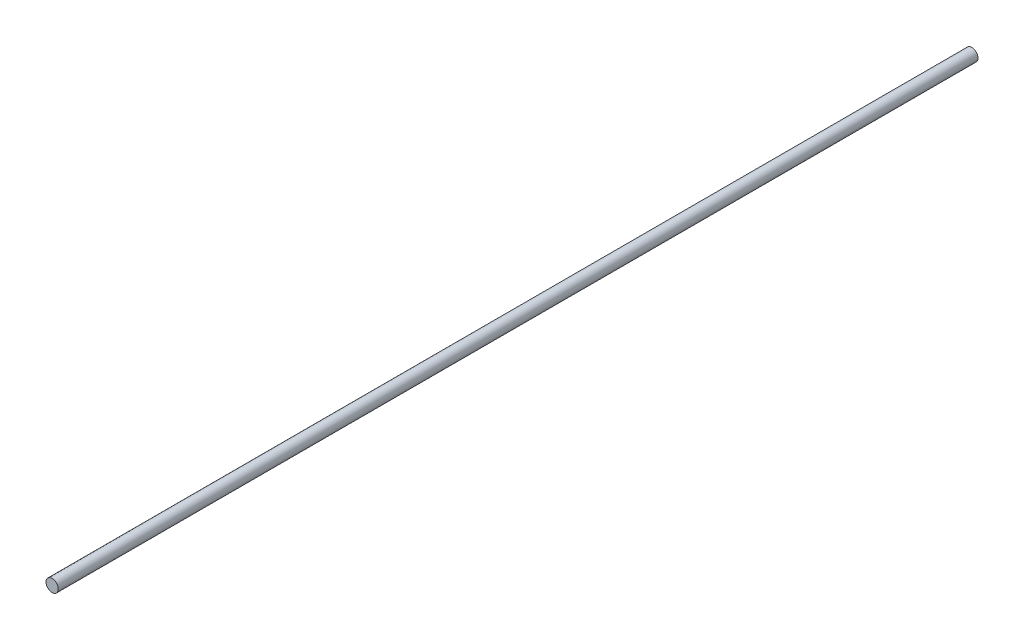
ISO-10303-21;
HEADER;
FILE_DESCRIPTION(('STEP AP214'),'2;1');
FILE_NAME('part.step','',(''),(''),'','','');
FILE_SCHEMA(('AUTOMOTIVE_DESIGN { 1 0 10303 214 1 1 1 1 }'));
ENDSEC;
DATA;
#1=APPLICATION_CONTEXT('core data for automotive mechanical design processes');
#2=APPLICATION_PROTOCOL_DEFINITION('international standard','automotive_design',2000,#1);
#3=PRODUCT_CONTEXT('',#1,'mechanical');
#4=PRODUCT('Part','Part','',(#3));
#5=PRODUCT_RELATED_PRODUCT_CATEGORY('part','',(#4));
#6=PRODUCT_DEFINITION_FORMATION('','',#4);
#7=PRODUCT_DEFINITION_CONTEXT('part definition',#1,'design');
#8=PRODUCT_DEFINITION('design','',#6,#7);
#9=PRODUCT_DEFINITION_SHAPE('','',#8);
#10=(LENGTH_UNIT() NAMED_UNIT(*) SI_UNIT(.MILLI.,.METRE.));
#11=(NAMED_UNIT(*) PLANE_ANGLE_UNIT() SI_UNIT($,.RADIAN.));
#12=(NAMED_UNIT(*) SI_UNIT($,.STERADIAN.) SOLID_ANGLE_UNIT());
#13=UNCERTAINTY_MEASURE_WITH_UNIT(LENGTH_MEASURE(1.E-05),#10,'distance_accuracy_value','');
#14=(GEOMETRIC_REPRESENTATION_CONTEXT(3) GLOBAL_UNCERTAINTY_ASSIGNED_CONTEXT((#13)) GLOBAL_UNIT_ASSIGNED_CONTEXT((#10,
#11,#12)) REPRESENTATION_CONTEXT('',''));
#15=CARTESIAN_POINT('',(0.,0.,0.));
#16=DIRECTION('',(0.,0.,1.));
#17=DIRECTION('',(1.,0.,0.));
#18=AXIS2_PLACEMENT_3D('',#15,#16,#17);
#19=CARTESIAN_POINT('',(0.,0.,600.));
#20=DIRECTION('',(0.,0.,-1.));
#21=DIRECTION('',(-1.,0.,0.));
#22=AXIS2_PLACEMENT_3D('',#19,#20,#21);
#23=CYLINDRICAL_SURFACE('',#22,4.);
#24=CARTESIAN_POINT('',(0.,0.,600.));
#25=DIRECTION('',(0.,0.,1.));
#26=DIRECTION('',(1.,0.,0.));
#27=AXIS2_PLACEMENT_3D('',#24,#25,#26);
#28=CIRCLE('',#27,4.);
#29=CARTESIAN_POINT('',(4.,0.,600.));
#30=VERTEX_POINT('',#29);
#31=EDGE_CURVE('E10',#30,#30,#28,.T.);
#32=ORIENTED_EDGE('',*,*,#31,.F.);
#33=EDGE_LOOP('',(#32));
#34=FACE_BOUND('',#33,.T.);
#35=CARTESIAN_POINT('',(0.,0.,0.));
#36=DIRECTION('',(0.,0.,1.));
#37=DIRECTION('',(1.,0.,0.));
#38=AXIS2_PLACEMENT_3D('',#35,#36,#37);
#39=CIRCLE('',#38,4.);
#40=CARTESIAN_POINT('',(4.,0.,0.));
#41=VERTEX_POINT('',#40);
#42=EDGE_CURVE('E36',#41,#41,#39,.T.);
#43=ORIENTED_EDGE('',*,*,#42,.T.);
#44=EDGE_LOOP('',(#43));
#45=FACE_BOUND('',#44,.T.);
#46=ADVANCED_FACE('F33',(#34,#45),#23,.T.);
#47=CARTESIAN_POINT('',(0.,0.,600.));
#48=DIRECTION('',(0.,0.,1.));
#49=DIRECTION('',(1.,0.,0.));
#50=AXIS2_PLACEMENT_3D('',#47,#48,#49);
#51=PLANE('',#50);
#52=ORIENTED_EDGE('',*,*,#31,.T.);
#53=EDGE_LOOP('',(#52));
#54=FACE_BOUND('',#53,.T.);
#55=ADVANCED_FACE('F48',(#54),#51,.T.);
#56=CARTESIAN_POINT('',(0.,0.,0.));
#57=DIRECTION('',(0.,0.,1.));
#58=DIRECTION('',(1.,0.,0.));
#59=AXIS2_PLACEMENT_3D('',#56,#57,#58);
#60=PLANE('',#59);
#61=ORIENTED_EDGE('',*,*,#42,.F.);
#62=EDGE_LOOP('',(#61));
#63=FACE_BOUND('',#62,.T.);
#64=ADVANCED_FACE('F46',(#63),#60,.F.);
#65=CLOSED_SHELL('',(#46,#55,#64));
#66=MANIFOLD_SOLID_BREP('B2',#65);
#67=ADVANCED_BREP_SHAPE_REPRESENTATION('',(#18,#66),#14);
#68=SHAPE_DEFINITION_REPRESENTATION(#9,#67);
ENDSEC;
END-ISO-10303-21;
